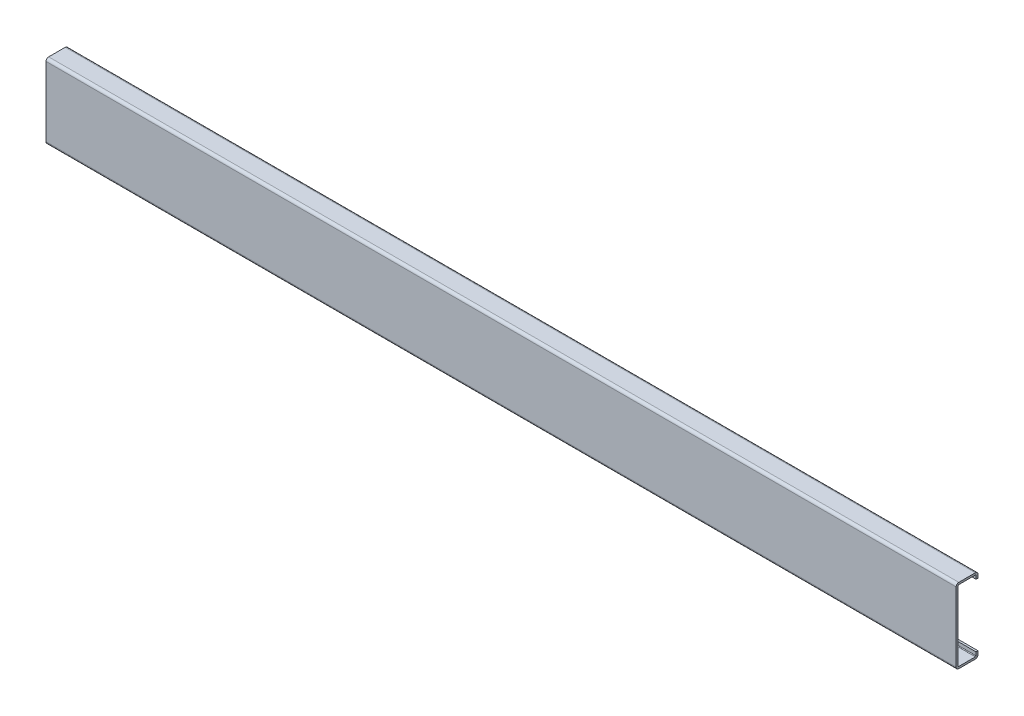
ISO-10303-21;
HEADER;
FILE_DESCRIPTION(('STEP AP214'),'2;1');
FILE_NAME('part.step','',(''),(''),'','','');
FILE_SCHEMA(('AUTOMOTIVE_DESIGN { 1 0 10303 214 1 1 1 1 }'));
ENDSEC;
DATA;
#1=APPLICATION_CONTEXT('core data for automotive mechanical design processes');
#2=APPLICATION_PROTOCOL_DEFINITION('international standard','automotive_design',2000,#1);
#3=PRODUCT_CONTEXT('',#1,'mechanical');
#4=PRODUCT('Part','Part','',(#3));
#5=PRODUCT_RELATED_PRODUCT_CATEGORY('part','',(#4));
#6=PRODUCT_DEFINITION_FORMATION('','',#4);
#7=PRODUCT_DEFINITION_CONTEXT('part definition',#1,'design');
#8=PRODUCT_DEFINITION('design','',#6,#7);
#9=PRODUCT_DEFINITION_SHAPE('','',#8);
#10=(LENGTH_UNIT() NAMED_UNIT(*) SI_UNIT(.MILLI.,.METRE.));
#11=(NAMED_UNIT(*) PLANE_ANGLE_UNIT() SI_UNIT($,.RADIAN.));
#12=(NAMED_UNIT(*) SI_UNIT($,.STERADIAN.) SOLID_ANGLE_UNIT());
#13=UNCERTAINTY_MEASURE_WITH_UNIT(LENGTH_MEASURE(1.E-05),#10,'distance_accuracy_value','');
#14=(GEOMETRIC_REPRESENTATION_CONTEXT(3) GLOBAL_UNCERTAINTY_ASSIGNED_CONTEXT((#13)) GLOBAL_UNIT_ASSIGNED_CONTEXT((#10,
#11,#12)) REPRESENTATION_CONTEXT('',''));
#15=CARTESIAN_POINT('',(0.,0.,0.));
#16=DIRECTION('',(0.,0.,1.));
#17=DIRECTION('',(1.,0.,0.));
#18=AXIS2_PLACEMENT_3D('',#15,#16,#17);
#19=CARTESIAN_POINT('',(550.,21.,-11.4));
#20=DIRECTION('',(0.,0.,-1.));
#21=DIRECTION('',(0.,1.,0.));
#22=AXIS2_PLACEMENT_3D('',#19,#20,#21);
#23=PLANE('',#22);
#24=DIRECTION('',(0.,-1.,0.));
#25=VECTOR('',#24,1.);
#26=CARTESIAN_POINT('',(0.,21.,-11.4));
#27=LINE('',#26,#25);
#28=CARTESIAN_POINT('',(0.,21.,-11.4));
#29=VERTEX_POINT('',#28);
#30=CARTESIAN_POINT('',(0.,19.,-11.4));
#31=VERTEX_POINT('',#30);
#32=EDGE_CURVE('E201',#29,#31,#27,.T.);
#33=ORIENTED_EDGE('',*,*,#32,.T.);
#34=DIRECTION('',(-1.,0.,0.));
#35=VECTOR('',#34,1.);
#36=CARTESIAN_POINT('',(550.,19.,-11.4));
#37=LINE('',#36,#35);
#38=CARTESIAN_POINT('',(550.,19.,-11.4));
#39=VERTEX_POINT('',#38);
#40=EDGE_CURVE('E11',#39,#31,#37,.T.);
#41=ORIENTED_EDGE('',*,*,#40,.F.);
#42=DIRECTION('',(0.,-1.,0.));
#43=VECTOR('',#42,1.);
#44=CARTESIAN_POINT('',(550.,21.,-11.4));
#45=LINE('',#44,#43);
#46=CARTESIAN_POINT('',(550.,21.,-11.4));
#47=VERTEX_POINT('',#46);
#48=EDGE_CURVE('E126',#47,#39,#45,.T.);
#49=ORIENTED_EDGE('',*,*,#48,.F.);
#50=DIRECTION('',(-1.,0.,0.));
#51=VECTOR('',#50,1.);
#52=CARTESIAN_POINT('',(550.,21.,-11.4));
#53=LINE('',#52,#51);
#54=EDGE_CURVE('E197',#47,#29,#53,.T.);
#55=ORIENTED_EDGE('',*,*,#54,.T.);
#56=EDGE_LOOP('',(#33,#41,#49,#55));
#57=FACE_BOUND('',#56,.T.);
#58=ADVANCED_FACE('F34',(#57),#23,.F.);
#59=CARTESIAN_POINT('',(550.,19.,-12.6));
#60=DIRECTION('',(0.,-1.,0.));
#61=DIRECTION('',(0.,0.,-1.));
#62=AXIS2_PLACEMENT_3D('',#59,#60,#61);
#63=PLANE('',#62);
#64=DIRECTION('',(0.,0.,1.));
#65=VECTOR('',#64,1.);
#66=CARTESIAN_POINT('',(0.,19.,-12.6));
#67=LINE('',#66,#65);
#68=CARTESIAN_POINT('',(0.,19.,-12.6));
#69=VERTEX_POINT('',#68);
#70=EDGE_CURVE('E204',#69,#31,#67,.T.);
#71=ORIENTED_EDGE('',*,*,#70,.F.);
#72=DIRECTION('',(-1.,0.,0.));
#73=VECTOR('',#72,1.);
#74=CARTESIAN_POINT('',(550.,19.,-12.6));
#75=LINE('',#74,#73);
#76=CARTESIAN_POINT('',(550.,19.,-12.6));
#77=VERTEX_POINT('',#76);
#78=EDGE_CURVE('E42',#77,#69,#75,.T.);
#79=ORIENTED_EDGE('',*,*,#78,.F.);
#80=DIRECTION('',(0.,0.,1.));
#81=VECTOR('',#80,1.);
#82=CARTESIAN_POINT('',(550.,19.,-12.6));
#83=LINE('',#82,#81);
#84=EDGE_CURVE('E306',#77,#39,#83,.T.);
#85=ORIENTED_EDGE('',*,*,#84,.T.);
#86=ORIENTED_EDGE('',*,*,#40,.T.);
#87=EDGE_LOOP('',(#71,#79,#85,#86));
#88=FACE_BOUND('',#87,.T.);
#89=ADVANCED_FACE('F293',(#88),#63,.T.);
#90=CARTESIAN_POINT('',(550.,21.,-12.6));
#91=DIRECTION('',(0.,0.,-1.));
#92=DIRECTION('',(0.,1.,0.));
#93=AXIS2_PLACEMENT_3D('',#90,#91,#92);
#94=PLANE('',#93);
#95=DIRECTION('',(0.,-1.,0.));
#96=VECTOR('',#95,1.);
#97=CARTESIAN_POINT('',(0.,21.,-12.6));
#98=LINE('',#97,#96);
#99=CARTESIAN_POINT('',(0.,21.,-12.6));
#100=VERTEX_POINT('',#99);
#101=EDGE_CURVE('E207',#100,#69,#98,.T.);
#102=ORIENTED_EDGE('',*,*,#101,.F.);
#103=DIRECTION('',(-1.,0.,0.));
#104=VECTOR('',#103,1.);
#105=CARTESIAN_POINT('',(550.,21.,-12.6));
#106=LINE('',#105,#104);
#107=CARTESIAN_POINT('',(550.,21.,-12.6));
#108=VERTEX_POINT('',#107);
#109=EDGE_CURVE('E283',#108,#100,#106,.T.);
#110=ORIENTED_EDGE('',*,*,#109,.F.);
#111=DIRECTION('',(0.,-1.,0.));
#112=VECTOR('',#111,1.);
#113=CARTESIAN_POINT('',(550.,21.,-12.6));
#114=LINE('',#113,#112);
#115=EDGE_CURVE('E290',#108,#77,#114,.T.);
#116=ORIENTED_EDGE('',*,*,#115,.T.);
#117=ORIENTED_EDGE('',*,*,#78,.T.);
#118=EDGE_LOOP('',(#102,#110,#116,#117));
#119=FACE_BOUND('',#118,.T.);
#120=ADVANCED_FACE('F288',(#119),#94,.T.);
#121=CARTESIAN_POINT('',(550.,21.,-11.));
#122=DIRECTION('',(-1.,0.,0.));
#123=DIRECTION('',(0.,0.,1.));
#124=AXIS2_PLACEMENT_3D('',#121,#122,#123);
#125=CYLINDRICAL_SURFACE('',#124,1.6);
#126=CARTESIAN_POINT('',(0.,21.,-11.));
#127=DIRECTION('',(1.,0.,0.));
#128=DIRECTION('',(0.,0.,-1.));
#129=AXIS2_PLACEMENT_3D('',#126,#127,#128);
#130=CIRCLE('',#129,1.6);
#131=CARTESIAN_POINT('',(0.,22.6,-11.));
#132=VERTEX_POINT('',#131);
#133=EDGE_CURVE('E210',#132,#100,#130,.F.);
#134=ORIENTED_EDGE('',*,*,#133,.F.);
#135=DIRECTION('',(-1.,0.,0.));
#136=VECTOR('',#135,1.);
#137=CARTESIAN_POINT('',(550.,22.6,-11.));
#138=LINE('',#137,#136);
#139=CARTESIAN_POINT('',(550.,22.6,-11.));
#140=VERTEX_POINT('',#139);
#141=EDGE_CURVE('E281',#140,#132,#138,.T.);
#142=ORIENTED_EDGE('',*,*,#141,.F.);
#143=CARTESIAN_POINT('',(550.,21.,-11.));
#144=DIRECTION('',(1.,0.,0.));
#145=DIRECTION('',(0.,0.,-1.));
#146=AXIS2_PLACEMENT_3D('',#143,#144,#145);
#147=CIRCLE('',#146,1.6);
#148=EDGE_CURVE('E303',#140,#108,#147,.F.);
#149=ORIENTED_EDGE('',*,*,#148,.T.);
#150=ORIENTED_EDGE('',*,*,#109,.T.);
#151=EDGE_LOOP('',(#134,#142,#149,#150));
#152=FACE_BOUND('',#151,.T.);
#153=ADVANCED_FACE('F300',(#152),#125,.T.);
#154=CARTESIAN_POINT('',(550.,22.6,-1.));
#155=DIRECTION('',(0.,1.,0.));
#156=DIRECTION('',(0.,0.,1.));
#157=AXIS2_PLACEMENT_3D('',#154,#155,#156);
#158=PLANE('',#157);
#159=DIRECTION('',(0.,0.,-1.));
#160=VECTOR('',#159,1.);
#161=CARTESIAN_POINT('',(0.,22.6,-1.));
#162=LINE('',#161,#160);
#163=CARTESIAN_POINT('',(0.,22.6,-1.));
#164=VERTEX_POINT('',#163);
#165=EDGE_CURVE('E213',#164,#132,#162,.T.);
#166=ORIENTED_EDGE('',*,*,#165,.F.);
#167=DIRECTION('',(-1.,0.,0.));
#168=VECTOR('',#167,1.);
#169=CARTESIAN_POINT('',(550.,22.6,-1.));
#170=LINE('',#169,#168);
#171=CARTESIAN_POINT('',(550.,22.6,-1.));
#172=VERTEX_POINT('',#171);
#173=EDGE_CURVE('E279',#172,#164,#170,.T.);
#174=ORIENTED_EDGE('',*,*,#173,.F.);
#175=DIRECTION('',(0.,0.,-1.));
#176=VECTOR('',#175,1.);
#177=CARTESIAN_POINT('',(550.,22.6,-1.));
#178=LINE('',#177,#176);
#179=EDGE_CURVE('E308',#172,#140,#178,.T.);
#180=ORIENTED_EDGE('',*,*,#179,.T.);
#181=ORIENTED_EDGE('',*,*,#141,.T.);
#182=EDGE_LOOP('',(#166,#174,#180,#181));
#183=FACE_BOUND('',#182,.T.);
#184=ADVANCED_FACE('F374',(#183),#158,.T.);
#185=CARTESIAN_POINT('',(550.,21.,-1.));
#186=DIRECTION('',(-1.,0.,0.));
#187=DIRECTION('',(0.,0.,1.));
#188=AXIS2_PLACEMENT_3D('',#185,#186,#187);
#189=CYLINDRICAL_SURFACE('',#188,1.6);
#190=CARTESIAN_POINT('',(0.,21.,-1.));
#191=DIRECTION('',(1.,0.,0.));
#192=DIRECTION('',(0.,0.,-1.));
#193=AXIS2_PLACEMENT_3D('',#190,#191,#192);
#194=CIRCLE('',#193,1.6);
#195=CARTESIAN_POINT('',(0.,21.,0.6));
#196=VERTEX_POINT('',#195);
#197=EDGE_CURVE('E216',#196,#164,#194,.F.);
#198=ORIENTED_EDGE('',*,*,#197,.F.);
#199=DIRECTION('',(-1.,0.,0.));
#200=VECTOR('',#199,1.);
#201=CARTESIAN_POINT('',(550.,21.,0.6));
#202=LINE('',#201,#200);
#203=CARTESIAN_POINT('',(550.,21.,0.6));
#204=VERTEX_POINT('',#203);
#205=EDGE_CURVE('E277',#204,#196,#202,.T.);
#206=ORIENTED_EDGE('',*,*,#205,.F.);
#207=CARTESIAN_POINT('',(550.,21.,-1.));
#208=DIRECTION('',(1.,0.,0.));
#209=DIRECTION('',(0.,0.,-1.));
#210=AXIS2_PLACEMENT_3D('',#207,#208,#209);
#211=CIRCLE('',#210,1.6);
#212=EDGE_CURVE('E314',#204,#172,#211,.F.);
#213=ORIENTED_EDGE('',*,*,#212,.T.);
#214=ORIENTED_EDGE('',*,*,#173,.T.);
#215=EDGE_LOOP('',(#198,#206,#213,#214));
#216=FACE_BOUND('',#215,.T.);
#217=ADVANCED_FACE('F377',(#216),#189,.T.);
#218=CARTESIAN_POINT('',(550.,-21.,0.6));
#219=DIRECTION('',(0.,0.,1.));
#220=DIRECTION('',(1.,0.,0.));
#221=AXIS2_PLACEMENT_3D('',#218,#219,#220);
#222=PLANE('',#221);
#223=DIRECTION('',(0.,1.,0.));
#224=VECTOR('',#223,1.);
#225=CARTESIAN_POINT('',(0.,-21.,0.6));
#226=LINE('',#225,#224);
#227=CARTESIAN_POINT('',(0.,-21.,0.6));
#228=VERTEX_POINT('',#227);
#229=EDGE_CURVE('E219',#228,#196,#226,.T.);
#230=ORIENTED_EDGE('',*,*,#229,.F.);
#231=DIRECTION('',(-1.,0.,0.));
#232=VECTOR('',#231,1.);
#233=CARTESIAN_POINT('',(550.,-21.,0.6));
#234=LINE('',#233,#232);
#235=CARTESIAN_POINT('',(550.,-21.,0.6));
#236=VERTEX_POINT('',#235);
#237=EDGE_CURVE('E275',#236,#228,#234,.T.);
#238=ORIENTED_EDGE('',*,*,#237,.F.);
#239=DIRECTION('',(0.,1.,0.));
#240=VECTOR('',#239,1.);
#241=CARTESIAN_POINT('',(550.,-21.,0.6));
#242=LINE('',#241,#240);
#243=EDGE_CURVE('E317',#236,#204,#242,.T.);
#244=ORIENTED_EDGE('',*,*,#243,.T.);
#245=ORIENTED_EDGE('',*,*,#205,.T.);
#246=EDGE_LOOP('',(#230,#238,#244,#245));
#247=FACE_BOUND('',#246,.T.);
#248=ADVANCED_FACE('F381',(#247),#222,.T.);
#249=CARTESIAN_POINT('',(550.,-21.,-1.));
#250=DIRECTION('',(-1.,0.,0.));
#251=DIRECTION('',(0.,0.,1.));
#252=AXIS2_PLACEMENT_3D('',#249,#250,#251);
#253=CYLINDRICAL_SURFACE('',#252,1.6);
#254=CARTESIAN_POINT('',(0.,-21.,-1.));
#255=DIRECTION('',(1.,0.,0.));
#256=DIRECTION('',(0.,0.,-1.));
#257=AXIS2_PLACEMENT_3D('',#254,#255,#256);
#258=CIRCLE('',#257,1.6);
#259=CARTESIAN_POINT('',(0.,-22.6,-1.));
#260=VERTEX_POINT('',#259);
#261=EDGE_CURVE('E222',#260,#228,#258,.F.);
#262=ORIENTED_EDGE('',*,*,#261,.F.);
#263=DIRECTION('',(-1.,0.,0.));
#264=VECTOR('',#263,1.);
#265=CARTESIAN_POINT('',(550.,-22.6,-1.));
#266=LINE('',#265,#264);
#267=CARTESIAN_POINT('',(550.,-22.6,-1.));
#268=VERTEX_POINT('',#267);
#269=EDGE_CURVE('E273',#268,#260,#266,.T.);
#270=ORIENTED_EDGE('',*,*,#269,.F.);
#271=CARTESIAN_POINT('',(550.,-21.,-1.));
#272=DIRECTION('',(1.,0.,0.));
#273=DIRECTION('',(0.,0.,-1.));
#274=AXIS2_PLACEMENT_3D('',#271,#272,#273);
#275=CIRCLE('',#274,1.6);
#276=EDGE_CURVE('E320',#268,#236,#275,.F.);
#277=ORIENTED_EDGE('',*,*,#276,.T.);
#278=ORIENTED_EDGE('',*,*,#237,.T.);
#279=EDGE_LOOP('',(#262,#270,#277,#278));
#280=FACE_BOUND('',#279,.T.);
#281=ADVANCED_FACE('F385',(#280),#253,.T.);
#282=CARTESIAN_POINT('',(550.,-22.6,-1.));
#283=DIRECTION('',(0.,-1.,0.));
#284=DIRECTION('',(0.,0.,-1.));
#285=AXIS2_PLACEMENT_3D('',#282,#283,#284);
#286=PLANE('',#285);
#287=DIRECTION('',(0.,0.,-1.));
#288=VECTOR('',#287,1.);
#289=CARTESIAN_POINT('',(0.,-22.6,-1.));
#290=LINE('',#289,#288);
#291=CARTESIAN_POINT('',(0.,-22.6,-11.));
#292=VERTEX_POINT('',#291);
#293=EDGE_CURVE('E225',#292,#260,#290,.F.);
#294=ORIENTED_EDGE('',*,*,#293,.F.);
#295=DIRECTION('',(-1.,0.,0.));
#296=VECTOR('',#295,1.);
#297=CARTESIAN_POINT('',(550.,-22.6,-11.));
#298=LINE('',#297,#296);
#299=CARTESIAN_POINT('',(550.,-22.6,-11.));
#300=VERTEX_POINT('',#299);
#301=EDGE_CURVE('E271',#300,#292,#298,.T.);
#302=ORIENTED_EDGE('',*,*,#301,.F.);
#303=DIRECTION('',(0.,0.,-1.));
#304=VECTOR('',#303,1.);
#305=CARTESIAN_POINT('',(550.,-22.6,-1.));
#306=LINE('',#305,#304);
#307=EDGE_CURVE('E323',#300,#268,#306,.F.);
#308=ORIENTED_EDGE('',*,*,#307,.T.);
#309=ORIENTED_EDGE('',*,*,#269,.T.);
#310=EDGE_LOOP('',(#294,#302,#308,#309));
#311=FACE_BOUND('',#310,.T.);
#312=ADVANCED_FACE('F389',(#311),#286,.T.);
#313=CARTESIAN_POINT('',(550.,-21.,-11.));
#314=DIRECTION('',(-1.,0.,0.));
#315=DIRECTION('',(0.,0.,1.));
#316=AXIS2_PLACEMENT_3D('',#313,#314,#315);
#317=CYLINDRICAL_SURFACE('',#316,1.6);
#318=CARTESIAN_POINT('',(0.,-21.,-11.));
#319=DIRECTION('',(1.,0.,0.));
#320=DIRECTION('',(0.,0.,-1.));
#321=AXIS2_PLACEMENT_3D('',#318,#319,#320);
#322=CIRCLE('',#321,1.6);
#323=CARTESIAN_POINT('',(0.,-21.,-12.6));
#324=VERTEX_POINT('',#323);
#325=EDGE_CURVE('E228',#324,#292,#322,.F.);
#326=ORIENTED_EDGE('',*,*,#325,.F.);
#327=DIRECTION('',(-1.,0.,0.));
#328=VECTOR('',#327,1.);
#329=CARTESIAN_POINT('',(550.,-21.,-12.6));
#330=LINE('',#329,#328);
#331=CARTESIAN_POINT('',(550.,-21.,-12.6));
#332=VERTEX_POINT('',#331);
#333=EDGE_CURVE('E269',#332,#324,#330,.T.);
#334=ORIENTED_EDGE('',*,*,#333,.F.);
#335=CARTESIAN_POINT('',(550.,-21.,-11.));
#336=DIRECTION('',(1.,0.,0.));
#337=DIRECTION('',(0.,0.,-1.));
#338=AXIS2_PLACEMENT_3D('',#335,#336,#337);
#339=CIRCLE('',#338,1.6);
#340=EDGE_CURVE('E326',#332,#300,#339,.F.);
#341=ORIENTED_EDGE('',*,*,#340,.T.);
#342=ORIENTED_EDGE('',*,*,#301,.T.);
#343=EDGE_LOOP('',(#326,#334,#341,#342));
#344=FACE_BOUND('',#343,.T.);
#345=ADVANCED_FACE('F393',(#344),#317,.T.);
#346=CARTESIAN_POINT('',(550.,-21.,-12.6));
#347=DIRECTION('',(0.,0.,-1.));
#348=DIRECTION('',(0.,1.,0.));
#349=AXIS2_PLACEMENT_3D('',#346,#347,#348);
#350=PLANE('',#349);
#351=DIRECTION('',(0.,-1.,0.));
#352=VECTOR('',#351,1.);
#353=CARTESIAN_POINT('',(0.,-21.,-12.6));
#354=LINE('',#353,#352);
#355=CARTESIAN_POINT('',(0.,-19.,-12.6));
#356=VERTEX_POINT('',#355);
#357=EDGE_CURVE('E231',#356,#324,#354,.T.);
#358=ORIENTED_EDGE('',*,*,#357,.F.);
#359=DIRECTION('',(-1.,0.,0.));
#360=VECTOR('',#359,1.);
#361=CARTESIAN_POINT('',(550.,-19.,-12.6));
#362=LINE('',#361,#360);
#363=CARTESIAN_POINT('',(550.,-19.,-12.6));
#364=VERTEX_POINT('',#363);
#365=EDGE_CURVE('E267',#364,#356,#362,.T.);
#366=ORIENTED_EDGE('',*,*,#365,.F.);
#367=DIRECTION('',(0.,-1.,0.));
#368=VECTOR('',#367,1.);
#369=CARTESIAN_POINT('',(550.,-21.,-12.6));
#370=LINE('',#369,#368);
#371=EDGE_CURVE('E329',#364,#332,#370,.T.);
#372=ORIENTED_EDGE('',*,*,#371,.T.);
#373=ORIENTED_EDGE('',*,*,#333,.T.);
#374=EDGE_LOOP('',(#358,#366,#372,#373));
#375=FACE_BOUND('',#374,.T.);
#376=ADVANCED_FACE('F397',(#375),#350,.T.);
#377=CARTESIAN_POINT('',(550.,-19.,-11.4));
#378=DIRECTION('',(0.,1.,0.));
#379=DIRECTION('',(0.,0.,1.));
#380=AXIS2_PLACEMENT_3D('',#377,#378,#379);
#381=PLANE('',#380);
#382=DIRECTION('',(0.,0.,-1.));
#383=VECTOR('',#382,1.);
#384=CARTESIAN_POINT('',(0.,-19.,-11.4));
#385=LINE('',#384,#383);
#386=CARTESIAN_POINT('',(0.,-19.,-11.4));
#387=VERTEX_POINT('',#386);
#388=EDGE_CURVE('E234',#387,#356,#385,.T.);
#389=ORIENTED_EDGE('',*,*,#388,.F.);
#390=DIRECTION('',(-1.,0.,0.));
#391=VECTOR('',#390,1.);
#392=CARTESIAN_POINT('',(550.,-19.,-11.4));
#393=LINE('',#392,#391);
#394=CARTESIAN_POINT('',(550.,-19.,-11.4));
#395=VERTEX_POINT('',#394);
#396=EDGE_CURVE('E265',#395,#387,#393,.T.);
#397=ORIENTED_EDGE('',*,*,#396,.F.);
#398=DIRECTION('',(0.,0.,-1.));
#399=VECTOR('',#398,1.);
#400=CARTESIAN_POINT('',(550.,-19.,-11.4));
#401=LINE('',#400,#399);
#402=EDGE_CURVE('E332',#395,#364,#401,.T.);
#403=ORIENTED_EDGE('',*,*,#402,.T.);
#404=ORIENTED_EDGE('',*,*,#365,.T.);
#405=EDGE_LOOP('',(#389,#397,#403,#404));
#406=FACE_BOUND('',#405,.T.);
#407=ADVANCED_FACE('F401',(#406),#381,.T.);
#408=CARTESIAN_POINT('',(550.,-21.,-11.4));
#409=DIRECTION('',(0.,0.,-1.));
#410=DIRECTION('',(0.,1.,0.));
#411=AXIS2_PLACEMENT_3D('',#408,#409,#410);
#412=PLANE('',#411);
#413=DIRECTION('',(0.,-1.,0.));
#414=VECTOR('',#413,1.);
#415=CARTESIAN_POINT('',(0.,-21.,-11.4));
#416=LINE('',#415,#414);
#417=CARTESIAN_POINT('',(0.,-21.,-11.4));
#418=VERTEX_POINT('',#417);
#419=EDGE_CURVE('E237',#387,#418,#416,.T.);
#420=ORIENTED_EDGE('',*,*,#419,.T.);
#421=DIRECTION('',(-1.,0.,0.));
#422=VECTOR('',#421,1.);
#423=CARTESIAN_POINT('',(550.,-21.,-11.4));
#424=LINE('',#423,#422);
#425=CARTESIAN_POINT('',(550.,-21.,-11.4));
#426=VERTEX_POINT('',#425);
#427=EDGE_CURVE('E262',#426,#418,#424,.T.);
#428=ORIENTED_EDGE('',*,*,#427,.F.);
#429=DIRECTION('',(0.,-1.,0.));
#430=VECTOR('',#429,1.);
#431=CARTESIAN_POINT('',(550.,-21.,-11.4));
#432=LINE('',#431,#430);
#433=EDGE_CURVE('E335',#395,#426,#432,.T.);
#434=ORIENTED_EDGE('',*,*,#433,.F.);
#435=ORIENTED_EDGE('',*,*,#396,.T.);
#436=EDGE_LOOP('',(#420,#428,#434,#435));
#437=FACE_BOUND('',#436,.T.);
#438=ADVANCED_FACE('F405',(#437),#412,.F.);
#439=CARTESIAN_POINT('',(550.,-21.,-11.));
#440=DIRECTION('',(-1.,0.,0.));
#441=DIRECTION('',(0.,0.,1.));
#442=AXIS2_PLACEMENT_3D('',#439,#440,#441);
#443=CYLINDRICAL_SURFACE('',#442,0.400000000000003);
#444=CARTESIAN_POINT('',(0.,-21.,-11.));
#445=DIRECTION('',(1.,0.,0.));
#446=DIRECTION('',(0.,0.,-1.));
#447=AXIS2_PLACEMENT_3D('',#444,#445,#446);
#448=CIRCLE('',#447,0.400000000000003);
#449=CARTESIAN_POINT('',(0.,-21.4,-11.));
#450=VERTEX_POINT('',#449);
#451=EDGE_CURVE('E239',#418,#450,#448,.F.);
#452=ORIENTED_EDGE('',*,*,#451,.T.);
#453=DIRECTION('',(-1.,0.,0.));
#454=VECTOR('',#453,1.);
#455=CARTESIAN_POINT('',(550.,-21.4,-11.));
#456=LINE('',#455,#454);
#457=CARTESIAN_POINT('',(550.,-21.4,-11.));
#458=VERTEX_POINT('',#457);
#459=EDGE_CURVE('E259',#458,#450,#456,.T.);
#460=ORIENTED_EDGE('',*,*,#459,.F.);
#461=CARTESIAN_POINT('',(550.,-21.,-11.));
#462=DIRECTION('',(1.,0.,0.));
#463=DIRECTION('',(0.,0.,-1.));
#464=AXIS2_PLACEMENT_3D('',#461,#462,#463);
#465=CIRCLE('',#464,0.400000000000003);
#466=EDGE_CURVE('E337',#426,#458,#465,.F.);
#467=ORIENTED_EDGE('',*,*,#466,.F.);
#468=ORIENTED_EDGE('',*,*,#427,.T.);
#469=EDGE_LOOP('',(#452,#460,#467,#468));
#470=FACE_BOUND('',#469,.T.);
#471=ADVANCED_FACE('F409',(#470),#443,.F.);
#472=CARTESIAN_POINT('',(550.,-21.4,-1.));
#473=DIRECTION('',(0.,-1.,0.));
#474=DIRECTION('',(0.,0.,-1.));
#475=AXIS2_PLACEMENT_3D('',#472,#473,#474);
#476=PLANE('',#475);
#477=DIRECTION('',(0.,0.,-1.));
#478=VECTOR('',#477,1.);
#479=CARTESIAN_POINT('',(0.,-21.4,-1.));
#480=LINE('',#479,#478);
#481=CARTESIAN_POINT('',(0.,-21.4,-1.));
#482=VERTEX_POINT('',#481);
#483=EDGE_CURVE('E241',#450,#482,#480,.F.);
#484=ORIENTED_EDGE('',*,*,#483,.T.);
#485=DIRECTION('',(-1.,0.,0.));
#486=VECTOR('',#485,1.);
#487=CARTESIAN_POINT('',(550.,-21.4,-1.));
#488=LINE('',#487,#486);
#489=CARTESIAN_POINT('',(550.,-21.4,-1.));
#490=VERTEX_POINT('',#489);
#491=EDGE_CURVE('E256',#490,#482,#488,.T.);
#492=ORIENTED_EDGE('',*,*,#491,.F.);
#493=DIRECTION('',(0.,0.,-1.));
#494=VECTOR('',#493,1.);
#495=CARTESIAN_POINT('',(550.,-21.4,-1.));
#496=LINE('',#495,#494);
#497=EDGE_CURVE('E339',#458,#490,#496,.F.);
#498=ORIENTED_EDGE('',*,*,#497,.F.);
#499=ORIENTED_EDGE('',*,*,#459,.T.);
#500=EDGE_LOOP('',(#484,#492,#498,#499));
#501=FACE_BOUND('',#500,.T.);
#502=ADVANCED_FACE('F413',(#501),#476,.F.);
#503=CARTESIAN_POINT('',(550.,-21.,-1.));
#504=DIRECTION('',(-1.,0.,0.));
#505=DIRECTION('',(0.,0.,1.));
#506=AXIS2_PLACEMENT_3D('',#503,#504,#505);
#507=CYLINDRICAL_SURFACE('',#506,0.400000000000001);
#508=CARTESIAN_POINT('',(0.,-21.,-1.));
#509=DIRECTION('',(1.,0.,0.));
#510=DIRECTION('',(0.,0.,-1.));
#511=AXIS2_PLACEMENT_3D('',#508,#509,#510);
#512=CIRCLE('',#511,0.400000000000001);
#513=CARTESIAN_POINT('',(0.,-21.,-0.6));
#514=VERTEX_POINT('',#513);
#515=EDGE_CURVE('E243',#482,#514,#512,.F.);
#516=ORIENTED_EDGE('',*,*,#515,.T.);
#517=DIRECTION('',(-1.,0.,0.));
#518=VECTOR('',#517,1.);
#519=CARTESIAN_POINT('',(550.,-21.,-0.6));
#520=LINE('',#519,#518);
#521=CARTESIAN_POINT('',(550.,-21.,-0.6));
#522=VERTEX_POINT('',#521);
#523=EDGE_CURVE('E253',#522,#514,#520,.T.);
#524=ORIENTED_EDGE('',*,*,#523,.F.);
#525=CARTESIAN_POINT('',(550.,-21.,-1.));
#526=DIRECTION('',(1.,0.,0.));
#527=DIRECTION('',(0.,0.,-1.));
#528=AXIS2_PLACEMENT_3D('',#525,#526,#527);
#529=CIRCLE('',#528,0.400000000000001);
#530=EDGE_CURVE('E341',#490,#522,#529,.F.);
#531=ORIENTED_EDGE('',*,*,#530,.F.);
#532=ORIENTED_EDGE('',*,*,#491,.T.);
#533=EDGE_LOOP('',(#516,#524,#531,#532));
#534=FACE_BOUND('',#533,.T.);
#535=ADVANCED_FACE('F347',(#534),#507,.F.);
#536=CARTESIAN_POINT('',(550.,-21.,-0.6));
#537=DIRECTION('',(0.,0.,1.));
#538=DIRECTION('',(1.,0.,0.));
#539=AXIS2_PLACEMENT_3D('',#536,#537,#538);
#540=PLANE('',#539);
#541=DIRECTION('',(0.,1.,0.));
#542=VECTOR('',#541,1.);
#543=CARTESIAN_POINT('',(0.,-21.,-0.6));
#544=LINE('',#543,#542);
#545=CARTESIAN_POINT('',(0.,21.,-0.6));
#546=VERTEX_POINT('',#545);
#547=EDGE_CURVE('E245',#514,#546,#544,.T.);
#548=ORIENTED_EDGE('',*,*,#547,.T.);
#549=DIRECTION('',(-1.,0.,0.));
#550=VECTOR('',#549,1.);
#551=CARTESIAN_POINT('',(550.,21.,-0.6));
#552=LINE('',#551,#550);
#553=CARTESIAN_POINT('',(550.,21.,-0.6));
#554=VERTEX_POINT('',#553);
#555=EDGE_CURVE('E192',#554,#546,#552,.T.);
#556=ORIENTED_EDGE('',*,*,#555,.F.);
#557=DIRECTION('',(0.,1.,0.));
#558=VECTOR('',#557,1.);
#559=CARTESIAN_POINT('',(550.,-21.,-0.6));
#560=LINE('',#559,#558);
#561=EDGE_CURVE('E183',#522,#554,#560,.T.);
#562=ORIENTED_EDGE('',*,*,#561,.F.);
#563=ORIENTED_EDGE('',*,*,#523,.T.);
#564=EDGE_LOOP('',(#548,#556,#562,#563));
#565=FACE_BOUND('',#564,.T.);
#566=ADVANCED_FACE('F351',(#565),#540,.F.);
#567=CARTESIAN_POINT('',(550.,21.,-1.));
#568=DIRECTION('',(-1.,0.,0.));
#569=DIRECTION('',(0.,0.,1.));
#570=AXIS2_PLACEMENT_3D('',#567,#568,#569);
#571=CYLINDRICAL_SURFACE('',#570,0.400000000000001);
#572=CARTESIAN_POINT('',(0.,21.,-1.));
#573=DIRECTION('',(1.,0.,0.));
#574=DIRECTION('',(0.,0.,-1.));
#575=AXIS2_PLACEMENT_3D('',#572,#573,#574);
#576=CIRCLE('',#575,0.400000000000001);
#577=CARTESIAN_POINT('',(0.,21.4,-1.));
#578=VERTEX_POINT('',#577);
#579=EDGE_CURVE('E191',#546,#578,#576,.F.);
#580=ORIENTED_EDGE('',*,*,#579,.T.);
#581=DIRECTION('',(-1.,0.,0.));
#582=VECTOR('',#581,1.);
#583=CARTESIAN_POINT('',(550.,21.4,-1.));
#584=LINE('',#583,#582);
#585=CARTESIAN_POINT('',(550.,21.4,-1.));
#586=VERTEX_POINT('',#585);
#587=EDGE_CURVE('E188',#586,#578,#584,.T.);
#588=ORIENTED_EDGE('',*,*,#587,.F.);
#589=CARTESIAN_POINT('',(550.,21.,-1.));
#590=DIRECTION('',(1.,0.,0.));
#591=DIRECTION('',(0.,0.,-1.));
#592=AXIS2_PLACEMENT_3D('',#589,#590,#591);
#593=CIRCLE('',#592,0.400000000000001);
#594=EDGE_CURVE('E177',#554,#586,#593,.F.);
#595=ORIENTED_EDGE('',*,*,#594,.F.);
#596=ORIENTED_EDGE('',*,*,#555,.T.);
#597=EDGE_LOOP('',(#580,#588,#595,#596));
#598=FACE_BOUND('',#597,.T.);
#599=ADVANCED_FACE('F189',(#598),#571,.F.);
#600=CARTESIAN_POINT('',(550.,21.4,-1.));
#601=DIRECTION('',(0.,1.,0.));
#602=DIRECTION('',(0.,0.,1.));
#603=AXIS2_PLACEMENT_3D('',#600,#601,#602);
#604=PLANE('',#603);
#605=DIRECTION('',(0.,0.,-1.));
#606=VECTOR('',#605,1.);
#607=CARTESIAN_POINT('',(0.,21.4,-1.));
#608=LINE('',#607,#606);
#609=CARTESIAN_POINT('',(0.,21.4,-11.));
#610=VERTEX_POINT('',#609);
#611=EDGE_CURVE('E114',#578,#610,#608,.T.);
#612=ORIENTED_EDGE('',*,*,#611,.T.);
#613=DIRECTION('',(-1.,0.,0.));
#614=VECTOR('',#613,1.);
#615=CARTESIAN_POINT('',(550.,21.4,-11.));
#616=LINE('',#615,#614);
#617=CARTESIAN_POINT('',(550.,21.4,-11.));
#618=VERTEX_POINT('',#617);
#619=EDGE_CURVE('E193',#618,#610,#616,.T.);
#620=ORIENTED_EDGE('',*,*,#619,.F.);
#621=DIRECTION('',(0.,0.,-1.));
#622=VECTOR('',#621,1.);
#623=CARTESIAN_POINT('',(550.,21.4,-1.));
#624=LINE('',#623,#622);
#625=EDGE_CURVE('E181',#586,#618,#624,.T.);
#626=ORIENTED_EDGE('',*,*,#625,.F.);
#627=ORIENTED_EDGE('',*,*,#587,.T.);
#628=EDGE_LOOP('',(#612,#620,#626,#627));
#629=FACE_BOUND('',#628,.T.);
#630=ADVANCED_FACE('F195',(#629),#604,.F.);
#631=CARTESIAN_POINT('',(550.,21.,-11.));
#632=DIRECTION('',(-1.,0.,0.));
#633=DIRECTION('',(0.,0.,1.));
#634=AXIS2_PLACEMENT_3D('',#631,#632,#633);
#635=CYLINDRICAL_SURFACE('',#634,0.400000000000003);
#636=CARTESIAN_POINT('',(0.,21.,-11.));
#637=DIRECTION('',(1.,0.,0.));
#638=DIRECTION('',(0.,0.,-1.));
#639=AXIS2_PLACEMENT_3D('',#636,#637,#638);
#640=CIRCLE('',#639,0.400000000000003);
#641=EDGE_CURVE('E120',#610,#29,#640,.F.);
#642=ORIENTED_EDGE('',*,*,#641,.T.);
#643=ORIENTED_EDGE('',*,*,#54,.F.);
#644=CARTESIAN_POINT('',(550.,21.,-11.));
#645=DIRECTION('',(1.,0.,0.));
#646=DIRECTION('',(0.,0.,-1.));
#647=AXIS2_PLACEMENT_3D('',#644,#645,#646);
#648=CIRCLE('',#647,0.400000000000003);
#649=EDGE_CURVE('E50',#618,#47,#648,.F.);
#650=ORIENTED_EDGE('',*,*,#649,.F.);
#651=ORIENTED_EDGE('',*,*,#619,.T.);
#652=EDGE_LOOP('',(#642,#643,#650,#651));
#653=FACE_BOUND('',#652,.T.);
#654=ADVANCED_FACE('F353',(#653),#635,.F.);
#655=CARTESIAN_POINT('',(550.,21.,-11.));
#656=DIRECTION('',(1.,0.,0.));
#657=DIRECTION('',(0.,0.,-1.));
#658=AXIS2_PLACEMENT_3D('',#655,#656,#657);
#659=PLANE('',#658);
#660=ORIENTED_EDGE('',*,*,#48,.T.);
#661=ORIENTED_EDGE('',*,*,#84,.F.);
#662=ORIENTED_EDGE('',*,*,#115,.F.);
#663=ORIENTED_EDGE('',*,*,#148,.F.);
#664=ORIENTED_EDGE('',*,*,#179,.F.);
#665=ORIENTED_EDGE('',*,*,#212,.F.);
#666=ORIENTED_EDGE('',*,*,#243,.F.);
#667=ORIENTED_EDGE('',*,*,#276,.F.);
#668=ORIENTED_EDGE('',*,*,#307,.F.);
#669=ORIENTED_EDGE('',*,*,#340,.F.);
#670=ORIENTED_EDGE('',*,*,#371,.F.);
#671=ORIENTED_EDGE('',*,*,#402,.F.);
#672=ORIENTED_EDGE('',*,*,#433,.T.);
#673=ORIENTED_EDGE('',*,*,#466,.T.);
#674=ORIENTED_EDGE('',*,*,#497,.T.);
#675=ORIENTED_EDGE('',*,*,#530,.T.);
#676=ORIENTED_EDGE('',*,*,#561,.T.);
#677=ORIENTED_EDGE('',*,*,#594,.T.);
#678=ORIENTED_EDGE('',*,*,#625,.T.);
#679=ORIENTED_EDGE('',*,*,#649,.T.);
#680=EDGE_LOOP('',(#660,#661,#662,#663,#664,#665,#666,#667,#668,#669,#670,#671,#672,#673,#674,
#675,#676,#677,#678,#679));
#681=FACE_BOUND('',#680,.T.);
#682=ADVANCED_FACE('F179',(#681),#659,.T.);
#683=CARTESIAN_POINT('',(0.,21.,-11.));
#684=DIRECTION('',(1.,0.,0.));
#685=DIRECTION('',(0.,0.,-1.));
#686=AXIS2_PLACEMENT_3D('',#683,#684,#685);
#687=PLANE('',#686);
#688=ORIENTED_EDGE('',*,*,#32,.F.);
#689=ORIENTED_EDGE('',*,*,#641,.F.);
#690=ORIENTED_EDGE('',*,*,#611,.F.);
#691=ORIENTED_EDGE('',*,*,#579,.F.);
#692=ORIENTED_EDGE('',*,*,#547,.F.);
#693=ORIENTED_EDGE('',*,*,#515,.F.);
#694=ORIENTED_EDGE('',*,*,#483,.F.);
#695=ORIENTED_EDGE('',*,*,#451,.F.);
#696=ORIENTED_EDGE('',*,*,#419,.F.);
#697=ORIENTED_EDGE('',*,*,#388,.T.);
#698=ORIENTED_EDGE('',*,*,#357,.T.);
#699=ORIENTED_EDGE('',*,*,#325,.T.);
#700=ORIENTED_EDGE('',*,*,#293,.T.);
#701=ORIENTED_EDGE('',*,*,#261,.T.);
#702=ORIENTED_EDGE('',*,*,#229,.T.);
#703=ORIENTED_EDGE('',*,*,#197,.T.);
#704=ORIENTED_EDGE('',*,*,#165,.T.);
#705=ORIENTED_EDGE('',*,*,#133,.T.);
#706=ORIENTED_EDGE('',*,*,#101,.T.);
#707=ORIENTED_EDGE('',*,*,#70,.T.);
#708=EDGE_LOOP('',(#688,#689,#690,#691,#692,#693,#694,#695,#696,#697,#698,#699,#700,#701,#702,
#703,#704,#705,#706,#707));
#709=FACE_BOUND('',#708,.T.);
#710=ADVANCED_FACE('F296',(#709),#687,.F.);
#711=CLOSED_SHELL('',(#58,#89,#120,#153,#184,#217,#248,#281,#312,#345,#376,#407,#438,#471,#502,
#535,#566,#599,#630,#654,#682,#710));
#712=MANIFOLD_SOLID_BREP('B2',#711);
#713=ADVANCED_BREP_SHAPE_REPRESENTATION('',(#18,#712),#14);
#714=SHAPE_DEFINITION_REPRESENTATION(#9,#713);
ENDSEC;
END-ISO-10303-21;
